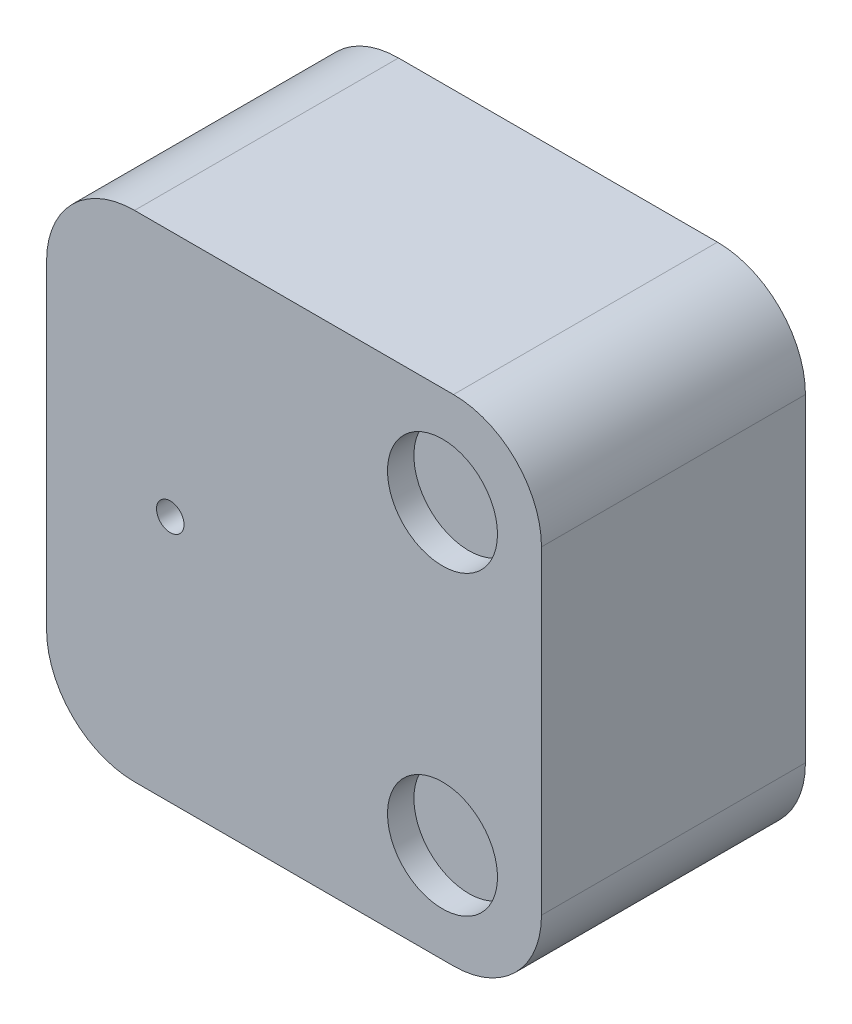
ISO-10303-21;
HEADER;
FILE_DESCRIPTION(('STEP AP214'),'2;1');
FILE_NAME('part.step','',(''),(''),'','','');
FILE_SCHEMA(('AUTOMOTIVE_DESIGN { 1 0 10303 214 1 1 1 1 }'));
ENDSEC;
DATA;
#1=APPLICATION_CONTEXT('core data for automotive mechanical design processes');
#2=APPLICATION_PROTOCOL_DEFINITION('international standard','automotive_design',2000,#1);
#3=PRODUCT_CONTEXT('',#1,'mechanical');
#4=PRODUCT('Part','Part','',(#3));
#5=PRODUCT_RELATED_PRODUCT_CATEGORY('part','',(#4));
#6=PRODUCT_DEFINITION_FORMATION('','',#4);
#7=PRODUCT_DEFINITION_CONTEXT('part definition',#1,'design');
#8=PRODUCT_DEFINITION('design','',#6,#7);
#9=PRODUCT_DEFINITION_SHAPE('','',#8);
#10=(LENGTH_UNIT() NAMED_UNIT(*) SI_UNIT(.MILLI.,.METRE.));
#11=(NAMED_UNIT(*) PLANE_ANGLE_UNIT() SI_UNIT($,.RADIAN.));
#12=(NAMED_UNIT(*) SI_UNIT($,.STERADIAN.) SOLID_ANGLE_UNIT());
#13=UNCERTAINTY_MEASURE_WITH_UNIT(LENGTH_MEASURE(1.E-05),#10,'distance_accuracy_value','');
#14=(GEOMETRIC_REPRESENTATION_CONTEXT(3) GLOBAL_UNCERTAINTY_ASSIGNED_CONTEXT((#13)) GLOBAL_UNIT_ASSIGNED_CONTEXT((#10,
#11,#12)) REPRESENTATION_CONTEXT('',''));
#15=CARTESIAN_POINT('',(0.,0.,0.));
#16=DIRECTION('',(0.,0.,1.));
#17=DIRECTION('',(1.,0.,0.));
#18=AXIS2_PLACEMENT_3D('',#15,#16,#17);
#19=CARTESIAN_POINT('',(90.,-90.,96.));
#20=DIRECTION('',(-1.,0.,0.));
#21=DIRECTION('',(0.,0.,1.));
#22=AXIS2_PLACEMENT_3D('',#19,#20,#21);
#23=PLANE('',#22);
#24=DIRECTION('',(0.,1.,0.));
#25=VECTOR('',#24,1.);
#26=CARTESIAN_POINT('',(90.,-90.,96.));
#27=LINE('',#26,#25);
#28=CARTESIAN_POINT('',(90.,-58.,96.));
#29=VERTEX_POINT('',#28);
#30=CARTESIAN_POINT('',(90.,57.9999999999999,96.));
#31=VERTEX_POINT('',#30);
#32=EDGE_CURVE('E140',#29,#31,#27,.T.);
#33=ORIENTED_EDGE('',*,*,#32,.F.);
#34=DIRECTION('',(0.,0.,-1.));
#35=VECTOR('',#34,1.);
#36=CARTESIAN_POINT('',(90.,-58.,96.));
#37=LINE('',#36,#35);
#38=CARTESIAN_POINT('',(90.,-58.,0.));
#39=VERTEX_POINT('',#38);
#40=EDGE_CURVE('E11',#29,#39,#37,.T.);
#41=ORIENTED_EDGE('',*,*,#40,.T.);
#42=DIRECTION('',(0.,1.,0.));
#43=VECTOR('',#42,1.);
#44=CARTESIAN_POINT('',(90.,-90.,0.));
#45=LINE('',#44,#43);
#46=CARTESIAN_POINT('',(90.,57.9999999999999,0.));
#47=VERTEX_POINT('',#46);
#48=EDGE_CURVE('E142',#39,#47,#45,.T.);
#49=ORIENTED_EDGE('',*,*,#48,.T.);
#50=DIRECTION('',(0.,0.,-1.));
#51=VECTOR('',#50,1.);
#52=CARTESIAN_POINT('',(90.,58.,96.));
#53=LINE('',#52,#51);
#54=EDGE_CURVE('E48',#47,#31,#53,.F.);
#55=ORIENTED_EDGE('',*,*,#54,.T.);
#56=EDGE_LOOP('',(#33,#41,#49,#55));
#57=FACE_BOUND('',#56,.T.);
#58=ADVANCED_FACE('F39',(#57),#23,.F.);
#59=CARTESIAN_POINT('',(-90.,90.,96.));
#60=DIRECTION('',(0.,-1.,0.));
#61=DIRECTION('',(0.,0.,-1.));
#62=AXIS2_PLACEMENT_3D('',#59,#60,#61);
#63=PLANE('',#62);
#64=DIRECTION('',(-1.,0.,0.));
#65=VECTOR('',#64,1.);
#66=CARTESIAN_POINT('',(-90.,90.,0.));
#67=LINE('',#66,#65);
#68=CARTESIAN_POINT('',(58.,90.,0.));
#69=VERTEX_POINT('',#68);
#70=CARTESIAN_POINT('',(-58.,90.,0.));
#71=VERTEX_POINT('',#70);
#72=EDGE_CURVE('E136',#69,#71,#67,.T.);
#73=ORIENTED_EDGE('',*,*,#72,.T.);
#74=DIRECTION('',(0.,0.,-1.));
#75=VECTOR('',#74,1.);
#76=CARTESIAN_POINT('',(-58.,90.,96.));
#77=LINE('',#76,#75);
#78=CARTESIAN_POINT('',(-58.,90.,96.));
#79=VERTEX_POINT('',#78);
#80=EDGE_CURVE('E112',#71,#79,#77,.F.);
#81=ORIENTED_EDGE('',*,*,#80,.T.);
#82=DIRECTION('',(-1.,0.,0.));
#83=VECTOR('',#82,1.);
#84=CARTESIAN_POINT('',(-90.,90.,96.));
#85=LINE('',#84,#83);
#86=CARTESIAN_POINT('',(58.,90.,96.));
#87=VERTEX_POINT('',#86);
#88=EDGE_CURVE('E192',#87,#79,#85,.T.);
#89=ORIENTED_EDGE('',*,*,#88,.F.);
#90=DIRECTION('',(0.,0.,-1.));
#91=VECTOR('',#90,1.);
#92=CARTESIAN_POINT('',(58.,90.,96.));
#93=LINE('',#92,#91);
#94=EDGE_CURVE('E118',#87,#69,#93,.T.);
#95=ORIENTED_EDGE('',*,*,#94,.T.);
#96=EDGE_LOOP('',(#73,#81,#89,#95));
#97=FACE_BOUND('',#96,.T.);
#98=ADVANCED_FACE('F196',(#97),#63,.F.);
#99=CARTESIAN_POINT('',(-90.,-90.,96.));
#100=DIRECTION('',(1.,0.,0.));
#101=DIRECTION('',(0.,0.,-1.));
#102=AXIS2_PLACEMENT_3D('',#99,#100,#101);
#103=PLANE('',#102);
#104=DIRECTION('',(0.,-1.,0.));
#105=VECTOR('',#104,1.);
#106=CARTESIAN_POINT('',(-90.,-90.,96.));
#107=LINE('',#106,#105);
#108=CARTESIAN_POINT('',(-90.,57.9999999999999,96.));
#109=VERTEX_POINT('',#108);
#110=CARTESIAN_POINT('',(-90.,-58.,96.));
#111=VERTEX_POINT('',#110);
#112=EDGE_CURVE('E127',#109,#111,#107,.T.);
#113=ORIENTED_EDGE('',*,*,#112,.F.);
#114=DIRECTION('',(0.,0.,-1.));
#115=VECTOR('',#114,1.);
#116=CARTESIAN_POINT('',(-90.,58.,96.));
#117=LINE('',#116,#115);
#118=CARTESIAN_POINT('',(-90.,57.9999999999999,0.));
#119=VERTEX_POINT('',#118);
#120=EDGE_CURVE('E111',#109,#119,#117,.T.);
#121=ORIENTED_EDGE('',*,*,#120,.T.);
#122=DIRECTION('',(0.,-1.,0.));
#123=VECTOR('',#122,1.);
#124=CARTESIAN_POINT('',(-90.,-90.,0.));
#125=LINE('',#124,#123);
#126=CARTESIAN_POINT('',(-90.,-58.,0.));
#127=VERTEX_POINT('',#126);
#128=EDGE_CURVE('E125',#119,#127,#125,.T.);
#129=ORIENTED_EDGE('',*,*,#128,.T.);
#130=DIRECTION('',(0.,0.,-1.));
#131=VECTOR('',#130,1.);
#132=CARTESIAN_POINT('',(-90.,-58.,96.));
#133=LINE('',#132,#131);
#134=EDGE_CURVE('E130',#127,#111,#133,.F.);
#135=ORIENTED_EDGE('',*,*,#134,.T.);
#136=EDGE_LOOP('',(#113,#121,#129,#135));
#137=FACE_BOUND('',#136,.T.);
#138=ADVANCED_FACE('F124',(#137),#103,.F.);
#139=CARTESIAN_POINT('',(-90.,-90.,96.));
#140=DIRECTION('',(0.,1.,0.));
#141=DIRECTION('',(0.,0.,1.));
#142=AXIS2_PLACEMENT_3D('',#139,#140,#141);
#143=PLANE('',#142);
#144=DIRECTION('',(1.,0.,0.));
#145=VECTOR('',#144,1.);
#146=CARTESIAN_POINT('',(-90.,-90.,96.));
#147=LINE('',#146,#145);
#148=CARTESIAN_POINT('',(-58.,-90.,96.));
#149=VERTEX_POINT('',#148);
#150=CARTESIAN_POINT('',(58.,-90.,96.));
#151=VERTEX_POINT('',#150);
#152=EDGE_CURVE('E147',#149,#151,#147,.T.);
#153=ORIENTED_EDGE('',*,*,#152,.F.);
#154=DIRECTION('',(0.,0.,-1.));
#155=VECTOR('',#154,1.);
#156=CARTESIAN_POINT('',(-58.,-90.,96.));
#157=LINE('',#156,#155);
#158=CARTESIAN_POINT('',(-58.,-90.,0.));
#159=VERTEX_POINT('',#158);
#160=EDGE_CURVE('E174',#149,#159,#157,.T.);
#161=ORIENTED_EDGE('',*,*,#160,.T.);
#162=DIRECTION('',(1.,0.,0.));
#163=VECTOR('',#162,1.);
#164=CARTESIAN_POINT('',(-90.,-90.,0.));
#165=LINE('',#164,#163);
#166=CARTESIAN_POINT('',(58.,-90.,0.));
#167=VERTEX_POINT('',#166);
#168=EDGE_CURVE('E135',#159,#167,#165,.T.);
#169=ORIENTED_EDGE('',*,*,#168,.T.);
#170=DIRECTION('',(0.,0.,-1.));
#171=VECTOR('',#170,1.);
#172=CARTESIAN_POINT('',(58.,-90.,96.));
#173=LINE('',#172,#171);
#174=EDGE_CURVE('E55',#167,#151,#173,.F.);
#175=ORIENTED_EDGE('',*,*,#174,.T.);
#176=EDGE_LOOP('',(#153,#161,#169,#175));
#177=FACE_BOUND('',#176,.T.);
#178=ADVANCED_FACE('F234',(#177),#143,.F.);
#179=CARTESIAN_POINT('',(0.,0.,96.));
#180=DIRECTION('',(0.,0.,-1.));
#181=DIRECTION('',(-1.,0.,0.));
#182=AXIS2_PLACEMENT_3D('',#179,#180,#181);
#183=PLANE('',#182);
#184=CARTESIAN_POINT('',(54.,54.,96.));
#185=DIRECTION('',(0.,0.,1.));
#186=DIRECTION('',(1.,0.,0.));
#187=AXIS2_PLACEMENT_3D('',#184,#185,#186);
#188=CIRCLE('',#187,20.);
#189=CARTESIAN_POINT('',(74.,54.,96.));
#190=VERTEX_POINT('',#189);
#191=EDGE_CURVE('E201',#190,#190,#188,.T.);
#192=ORIENTED_EDGE('',*,*,#191,.F.);
#193=EDGE_LOOP('',(#192));
#194=FACE_BOUND('',#193,.T.);
#195=CARTESIAN_POINT('',(54.,-54.,96.));
#196=DIRECTION('',(0.,0.,1.));
#197=DIRECTION('',(-1.,0.,0.));
#198=AXIS2_PLACEMENT_3D('',#195,#196,#197);
#199=CIRCLE('',#198,20.);
#200=CARTESIAN_POINT('',(34.,-54.,96.));
#201=VERTEX_POINT('',#200);
#202=EDGE_CURVE('E218',#201,#201,#199,.T.);
#203=ORIENTED_EDGE('',*,*,#202,.F.);
#204=EDGE_LOOP('',(#203));
#205=FACE_BOUND('',#204,.T.);
#206=CARTESIAN_POINT('',(-45.,0.,96.));
#207=DIRECTION('',(0.,0.,1.));
#208=DIRECTION('',(1.,0.,0.));
#209=AXIS2_PLACEMENT_3D('',#206,#207,#208);
#210=CIRCLE('',#209,5.);
#211=CARTESIAN_POINT('',(-40.,0.,96.));
#212=VERTEX_POINT('',#211);
#213=EDGE_CURVE('E210',#212,#212,#210,.T.);
#214=ORIENTED_EDGE('',*,*,#213,.F.);
#215=EDGE_LOOP('',(#214));
#216=FACE_BOUND('',#215,.T.);
#217=ORIENTED_EDGE('',*,*,#88,.T.);
#218=CARTESIAN_POINT('',(-58.,58.,96.));
#219=DIRECTION('',(0.,0.,-1.));
#220=DIRECTION('',(-1.,0.,0.));
#221=AXIS2_PLACEMENT_3D('',#218,#219,#220);
#222=CIRCLE('',#221,32.);
#223=EDGE_CURVE('E169',#79,#109,#222,.F.);
#224=ORIENTED_EDGE('',*,*,#223,.T.);
#225=ORIENTED_EDGE('',*,*,#112,.T.);
#226=CARTESIAN_POINT('',(-58.,-58.,96.));
#227=DIRECTION('',(0.,0.,-1.));
#228=DIRECTION('',(-1.,0.,0.));
#229=AXIS2_PLACEMENT_3D('',#226,#227,#228);
#230=CIRCLE('',#229,32.);
#231=EDGE_CURVE('E62',#111,#149,#230,.F.);
#232=ORIENTED_EDGE('',*,*,#231,.T.);
#233=ORIENTED_EDGE('',*,*,#152,.T.);
#234=CARTESIAN_POINT('',(58.,-58.,96.));
#235=DIRECTION('',(0.,0.,-1.));
#236=DIRECTION('',(-1.,0.,0.));
#237=AXIS2_PLACEMENT_3D('',#234,#235,#236);
#238=CIRCLE('',#237,32.);
#239=EDGE_CURVE('E164',#151,#29,#238,.F.);
#240=ORIENTED_EDGE('',*,*,#239,.T.);
#241=ORIENTED_EDGE('',*,*,#32,.T.);
#242=CARTESIAN_POINT('',(58.,58.,96.));
#243=DIRECTION('',(0.,0.,-1.));
#244=DIRECTION('',(-1.,0.,0.));
#245=AXIS2_PLACEMENT_3D('',#242,#243,#244);
#246=CIRCLE('',#245,32.);
#247=EDGE_CURVE('E161',#31,#87,#246,.F.);
#248=ORIENTED_EDGE('',*,*,#247,.T.);
#249=EDGE_LOOP('',(#217,#224,#225,#232,#233,#240,#241,#248));
#250=FACE_BOUND('',#249,.T.);
#251=ADVANCED_FACE('F188',(#194,#205,#216,#250),#183,.F.);
#252=CARTESIAN_POINT('',(0.,0.,0.));
#253=DIRECTION('',(0.,0.,-1.));
#254=DIRECTION('',(-1.,0.,0.));
#255=AXIS2_PLACEMENT_3D('',#252,#253,#254);
#256=PLANE('',#255);
#257=ORIENTED_EDGE('',*,*,#128,.F.);
#258=CARTESIAN_POINT('',(-58.,58.,0.));
#259=DIRECTION('',(0.,0.,-1.));
#260=DIRECTION('',(-1.,0.,0.));
#261=AXIS2_PLACEMENT_3D('',#258,#259,#260);
#262=CIRCLE('',#261,32.);
#263=EDGE_CURVE('E107',#119,#71,#262,.T.);
#264=ORIENTED_EDGE('',*,*,#263,.T.);
#265=ORIENTED_EDGE('',*,*,#72,.F.);
#266=CARTESIAN_POINT('',(58.,58.,0.));
#267=DIRECTION('',(0.,0.,-1.));
#268=DIRECTION('',(-1.,0.,0.));
#269=AXIS2_PLACEMENT_3D('',#266,#267,#268);
#270=CIRCLE('',#269,32.);
#271=EDGE_CURVE('E129',#69,#47,#270,.T.);
#272=ORIENTED_EDGE('',*,*,#271,.T.);
#273=ORIENTED_EDGE('',*,*,#48,.F.);
#274=CARTESIAN_POINT('',(58.,-58.,0.));
#275=DIRECTION('',(0.,0.,-1.));
#276=DIRECTION('',(-1.,0.,0.));
#277=AXIS2_PLACEMENT_3D('',#274,#275,#276);
#278=CIRCLE('',#277,32.);
#279=EDGE_CURVE('E151',#39,#167,#278,.T.);
#280=ORIENTED_EDGE('',*,*,#279,.T.);
#281=ORIENTED_EDGE('',*,*,#168,.F.);
#282=CARTESIAN_POINT('',(-58.,-58.,0.));
#283=DIRECTION('',(0.,0.,-1.));
#284=DIRECTION('',(-1.,0.,0.));
#285=AXIS2_PLACEMENT_3D('',#282,#283,#284);
#286=CIRCLE('',#285,32.);
#287=EDGE_CURVE('E119',#159,#127,#286,.T.);
#288=ORIENTED_EDGE('',*,*,#287,.T.);
#289=EDGE_LOOP('',(#257,#264,#265,#272,#273,#280,#281,#288));
#290=FACE_BOUND('',#289,.T.);
#291=ADVANCED_FACE('F132',(#290),#256,.T.);
#292=CARTESIAN_POINT('',(-58.,58.,96.));
#293=DIRECTION('',(0.,0.,-1.));
#294=DIRECTION('',(-1.,0.,0.));
#295=AXIS2_PLACEMENT_3D('',#292,#293,#294);
#296=CYLINDRICAL_SURFACE('',#295,32.);
#297=ORIENTED_EDGE('',*,*,#223,.F.);
#298=ORIENTED_EDGE('',*,*,#80,.F.);
#299=ORIENTED_EDGE('',*,*,#263,.F.);
#300=ORIENTED_EDGE('',*,*,#120,.F.);
#301=EDGE_LOOP('',(#297,#298,#299,#300));
#302=FACE_BOUND('',#301,.T.);
#303=ADVANCED_FACE('F110',(#302),#296,.T.);
#304=CARTESIAN_POINT('',(-58.,-58.,96.));
#305=DIRECTION('',(0.,0.,-1.));
#306=DIRECTION('',(-1.,0.,0.));
#307=AXIS2_PLACEMENT_3D('',#304,#305,#306);
#308=CYLINDRICAL_SURFACE('',#307,32.);
#309=ORIENTED_EDGE('',*,*,#231,.F.);
#310=ORIENTED_EDGE('',*,*,#134,.F.);
#311=ORIENTED_EDGE('',*,*,#287,.F.);
#312=ORIENTED_EDGE('',*,*,#160,.F.);
#313=EDGE_LOOP('',(#309,#310,#311,#312));
#314=FACE_BOUND('',#313,.T.);
#315=ADVANCED_FACE('F264',(#314),#308,.T.);
#316=CARTESIAN_POINT('',(58.,-58.,96.));
#317=DIRECTION('',(0.,0.,-1.));
#318=DIRECTION('',(-1.,0.,0.));
#319=AXIS2_PLACEMENT_3D('',#316,#317,#318);
#320=CYLINDRICAL_SURFACE('',#319,32.);
#321=ORIENTED_EDGE('',*,*,#239,.F.);
#322=ORIENTED_EDGE('',*,*,#174,.F.);
#323=ORIENTED_EDGE('',*,*,#279,.F.);
#324=ORIENTED_EDGE('',*,*,#40,.F.);
#325=EDGE_LOOP('',(#321,#322,#323,#324));
#326=FACE_BOUND('',#325,.T.);
#327=ADVANCED_FACE('F252',(#326),#320,.T.);
#328=CARTESIAN_POINT('',(58.,58.,96.));
#329=DIRECTION('',(0.,0.,-1.));
#330=DIRECTION('',(-1.,0.,0.));
#331=AXIS2_PLACEMENT_3D('',#328,#329,#330);
#332=CYLINDRICAL_SURFACE('',#331,32.);
#333=ORIENTED_EDGE('',*,*,#247,.F.);
#334=ORIENTED_EDGE('',*,*,#54,.F.);
#335=ORIENTED_EDGE('',*,*,#271,.F.);
#336=ORIENTED_EDGE('',*,*,#94,.F.);
#337=EDGE_LOOP('',(#333,#334,#335,#336));
#338=FACE_BOUND('',#337,.T.);
#339=ADVANCED_FACE('F41',(#338),#332,.T.);
#340=CARTESIAN_POINT('',(-45.,0.,86.4));
#341=DIRECTION('',(0.,0.,1.));
#342=DIRECTION('',(1.,0.,0.));
#343=AXIS2_PLACEMENT_3D('',#340,#341,#342);
#344=CYLINDRICAL_SURFACE('',#343,5.);
#345=CARTESIAN_POINT('',(-45.,0.,86.4));
#346=DIRECTION('',(0.,0.,1.));
#347=DIRECTION('',(1.,0.,0.));
#348=AXIS2_PLACEMENT_3D('',#345,#346,#347);
#349=CIRCLE('',#348,5.);
#350=CARTESIAN_POINT('',(-40.,0.,86.4));
#351=VERTEX_POINT('',#350);
#352=EDGE_CURVE('E214',#351,#351,#349,.T.);
#353=ORIENTED_EDGE('',*,*,#352,.F.);
#354=EDGE_LOOP('',(#353));
#355=FACE_BOUND('',#354,.T.);
#356=ORIENTED_EDGE('',*,*,#213,.T.);
#357=EDGE_LOOP('',(#356));
#358=FACE_BOUND('',#357,.T.);
#359=ADVANCED_FACE('F240',(#355,#358),#344,.F.);
#360=CARTESIAN_POINT('',(-45.,0.,86.4));
#361=DIRECTION('',(0.,0.,1.));
#362=DIRECTION('',(1.,0.,0.));
#363=AXIS2_PLACEMENT_3D('',#360,#361,#362);
#364=PLANE('',#363);
#365=ORIENTED_EDGE('',*,*,#352,.T.);
#366=EDGE_LOOP('',(#365));
#367=FACE_BOUND('',#366,.T.);
#368=ADVANCED_FACE('F242',(#367),#364,.T.);
#369=CARTESIAN_POINT('',(54.,-54.,86.4));
#370=DIRECTION('',(0.,0.,1.));
#371=DIRECTION('',(1.,0.,0.));
#372=AXIS2_PLACEMENT_3D('',#369,#370,#371);
#373=CYLINDRICAL_SURFACE('',#372,20.);
#374=CARTESIAN_POINT('',(54.,-54.,86.4));
#375=DIRECTION('',(0.,0.,1.));
#376=DIRECTION('',(-1.,0.,0.));
#377=AXIS2_PLACEMENT_3D('',#374,#375,#376);
#378=CIRCLE('',#377,20.);
#379=CARTESIAN_POINT('',(34.,-54.,86.4));
#380=VERTEX_POINT('',#379);
#381=EDGE_CURVE('E222',#380,#380,#378,.T.);
#382=ORIENTED_EDGE('',*,*,#381,.F.);
#383=EDGE_LOOP('',(#382));
#384=FACE_BOUND('',#383,.T.);
#385=ORIENTED_EDGE('',*,*,#202,.T.);
#386=EDGE_LOOP('',(#385));
#387=FACE_BOUND('',#386,.T.);
#388=ADVANCED_FACE('F249',(#384,#387),#373,.F.);
#389=CARTESIAN_POINT('',(54.,-54.,86.4));
#390=DIRECTION('',(0.,0.,-1.));
#391=DIRECTION('',(-1.,0.,0.));
#392=AXIS2_PLACEMENT_3D('',#389,#390,#391);
#393=PLANE('',#392);
#394=ORIENTED_EDGE('',*,*,#381,.T.);
#395=EDGE_LOOP('',(#394));
#396=FACE_BOUND('',#395,.T.);
#397=ADVANCED_FACE('F306',(#396),#393,.F.);
#398=CARTESIAN_POINT('',(54.,54.,86.4));
#399=DIRECTION('',(0.,0.,1.));
#400=DIRECTION('',(1.,0.,0.));
#401=AXIS2_PLACEMENT_3D('',#398,#399,#400);
#402=CYLINDRICAL_SURFACE('',#401,20.);
#403=CARTESIAN_POINT('',(54.,54.,86.4));
#404=DIRECTION('',(0.,0.,1.));
#405=DIRECTION('',(1.,0.,0.));
#406=AXIS2_PLACEMENT_3D('',#403,#404,#405);
#407=CIRCLE('',#406,20.);
#408=CARTESIAN_POINT('',(74.,54.,86.4));
#409=VERTEX_POINT('',#408);
#410=EDGE_CURVE('E198',#409,#409,#407,.T.);
#411=ORIENTED_EDGE('',*,*,#410,.F.);
#412=EDGE_LOOP('',(#411));
#413=FACE_BOUND('',#412,.T.);
#414=ORIENTED_EDGE('',*,*,#191,.T.);
#415=EDGE_LOOP('',(#414));
#416=FACE_BOUND('',#415,.T.);
#417=ADVANCED_FACE('F230',(#413,#416),#402,.F.);
#418=CARTESIAN_POINT('',(54.,54.,86.4));
#419=DIRECTION('',(0.,0.,1.));
#420=DIRECTION('',(1.,0.,0.));
#421=AXIS2_PLACEMENT_3D('',#418,#419,#420);
#422=PLANE('',#421);
#423=ORIENTED_EDGE('',*,*,#410,.T.);
#424=EDGE_LOOP('',(#423));
#425=FACE_BOUND('',#424,.T.);
#426=ADVANCED_FACE('F325',(#425),#422,.T.);
#427=CLOSED_SHELL('',(#58,#98,#138,#178,#251,#291,#303,#315,#327,#339,#359,#368,#388,#397,#417,#426));
#428=MANIFOLD_SOLID_BREP('B2',#427);
#429=ADVANCED_BREP_SHAPE_REPRESENTATION('',(#18,#428),#14);
#430=SHAPE_DEFINITION_REPRESENTATION(#9,#429);
ENDSEC;
END-ISO-10303-21;
